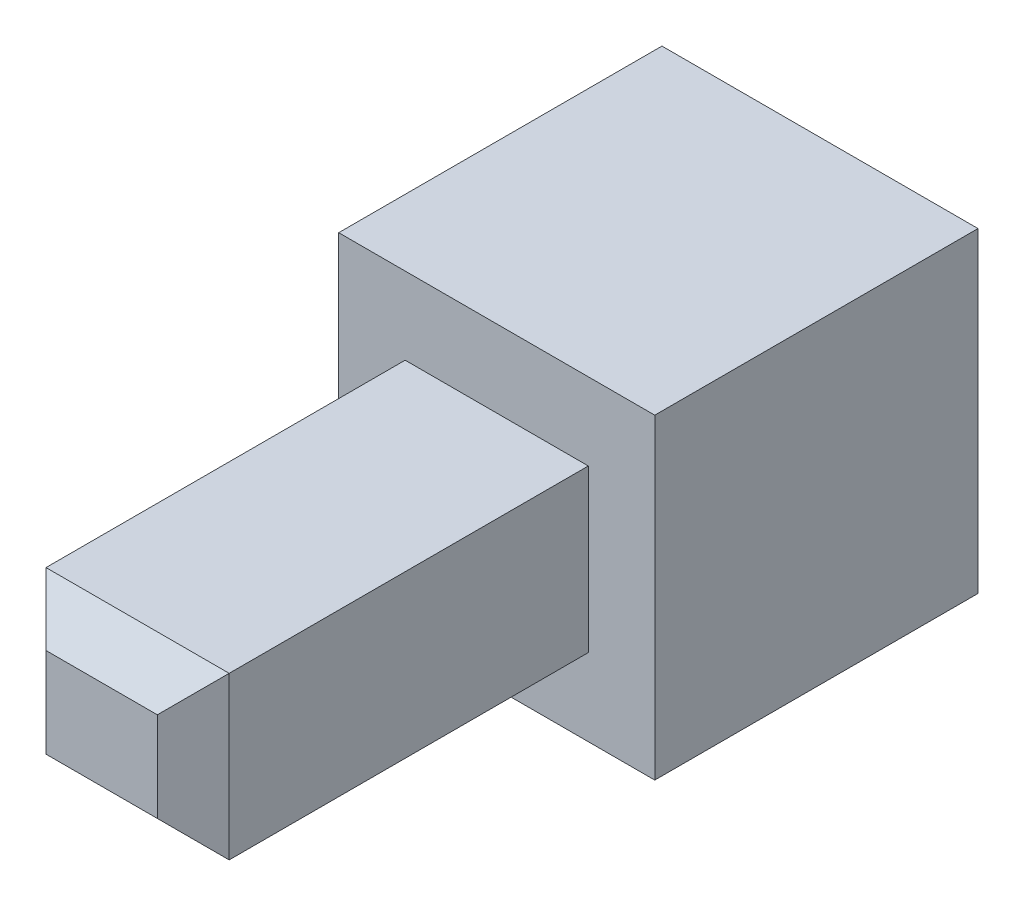
ISO-10303-21;
HEADER;
FILE_DESCRIPTION(('STEP AP214'),'2;1');
FILE_NAME('part.step','',(''),(''),'','','');
FILE_SCHEMA(('AUTOMOTIVE_DESIGN { 1 0 10303 214 1 1 1 1 }'));
ENDSEC;
DATA;
#1=APPLICATION_CONTEXT('core data for automotive mechanical design processes');
#2=APPLICATION_PROTOCOL_DEFINITION('international standard','automotive_design',2000,#1);
#3=PRODUCT_CONTEXT('',#1,'mechanical');
#4=PRODUCT('Part','Part','',(#3));
#5=PRODUCT_RELATED_PRODUCT_CATEGORY('part','',(#4));
#6=PRODUCT_DEFINITION_FORMATION('','',#4);
#7=PRODUCT_DEFINITION_CONTEXT('part definition',#1,'design');
#8=PRODUCT_DEFINITION('design','',#6,#7);
#9=PRODUCT_DEFINITION_SHAPE('','',#8);
#10=(LENGTH_UNIT() NAMED_UNIT(*) SI_UNIT(.MILLI.,.METRE.));
#11=(NAMED_UNIT(*) PLANE_ANGLE_UNIT() SI_UNIT($,.RADIAN.));
#12=(NAMED_UNIT(*) SI_UNIT($,.STERADIAN.) SOLID_ANGLE_UNIT());
#13=UNCERTAINTY_MEASURE_WITH_UNIT(LENGTH_MEASURE(1.E-05),#10,'distance_accuracy_value','');
#14=(GEOMETRIC_REPRESENTATION_CONTEXT(3) GLOBAL_UNCERTAINTY_ASSIGNED_CONTEXT((#13)) GLOBAL_UNIT_ASSIGNED_CONTEXT((#10,
#11,#12)) REPRESENTATION_CONTEXT('',''));
#15=CARTESIAN_POINT('',(0.,0.,0.));
#16=DIRECTION('',(0.,0.,1.));
#17=DIRECTION('',(1.,0.,0.));
#18=AXIS2_PLACEMENT_3D('',#15,#16,#17);
#19=CARTESIAN_POINT('',(-33.152555071098,95.682627612663,-10.400000378181));
#20=DIRECTION('',(1.,0.,0.));
#21=DIRECTION('',(0.,0.,-1.));
#22=AXIS2_PLACEMENT_3D('',#19,#20,#21);
#23=PLANE('',#22);
#24=DIRECTION('',(0.,0.,-1.));
#25=VECTOR('',#24,1.);
#26=CARTESIAN_POINT('',(-33.152555071098,95.682627612663,-10.400000378181));
#27=LINE('',#26,#25);
#28=CARTESIAN_POINT('',(-33.152555071098,95.682627612663,-5.40000037818102));
#29=VERTEX_POINT('',#28);
#30=CARTESIAN_POINT('',(-33.152555071098,95.682627612663,-14.400000378181));
#31=VERTEX_POINT('',#30);
#32=EDGE_CURVE('E223',#29,#31,#27,.T.);
#33=ORIENTED_EDGE('',*,*,#32,.T.);
#34=DIRECTION('',(0.,-1.,0.));
#35=VECTOR('',#34,1.);
#36=CARTESIAN_POINT('',(-33.152555071098,95.682627612663,-14.400000378181));
#37=LINE('',#36,#35);
#38=CARTESIAN_POINT('',(-33.152555071098,86.882627803397,-14.400000378181));
#39=VERTEX_POINT('',#38);
#40=EDGE_CURVE('E191',#31,#39,#37,.T.);
#41=ORIENTED_EDGE('',*,*,#40,.T.);
#42=DIRECTION('',(0.,0.,-1.));
#43=VECTOR('',#42,1.);
#44=CARTESIAN_POINT('',(-33.152555071098,86.882627803397,-10.400000378181));
#45=LINE('',#44,#43);
#46=CARTESIAN_POINT('',(-33.152555071098,86.882627803397,-5.40000037818102));
#47=VERTEX_POINT('',#46);
#48=EDGE_CURVE('E229',#47,#39,#45,.T.);
#49=ORIENTED_EDGE('',*,*,#48,.F.);
#50=DIRECTION('',(0.,-1.,0.));
#51=VECTOR('',#50,1.);
#52=CARTESIAN_POINT('',(-33.152555071098,95.682627612663,-5.40000037818102));
#53=LINE('',#52,#51);
#54=EDGE_CURVE('E167',#29,#47,#53,.T.);
#55=ORIENTED_EDGE('',*,*,#54,.F.);
#56=EDGE_LOOP('',(#33,#41,#49,#55));
#57=FACE_BOUND('',#56,.T.);
#58=ADVANCED_FACE('F37',(#57),#23,.F.);
#59=CARTESIAN_POINT('',(-33.152555071098,86.882627803397,-10.400000378181));
#60=DIRECTION('',(0.,1.,0.));
#61=DIRECTION('',(0.,0.,1.));
#62=AXIS2_PLACEMENT_3D('',#59,#60,#61);
#63=PLANE('',#62);
#64=ORIENTED_EDGE('',*,*,#48,.T.);
#65=DIRECTION('',(1.,0.,0.));
#66=VECTOR('',#65,1.);
#67=CARTESIAN_POINT('',(-33.152555071098,86.882627803397,-14.400000378181));
#68=LINE('',#67,#66);
#69=CARTESIAN_POINT('',(-24.352555261832,86.882627803397,-14.400000378181));
#70=VERTEX_POINT('',#69);
#71=EDGE_CURVE('E194',#39,#70,#68,.T.);
#72=ORIENTED_EDGE('',*,*,#71,.T.);
#73=DIRECTION('',(0.,0.,-1.));
#74=VECTOR('',#73,1.);
#75=CARTESIAN_POINT('',(-24.352555261832,86.882627803397,-10.400000378181));
#76=LINE('',#75,#74);
#77=CARTESIAN_POINT('',(-24.352555261832,86.882627803397,-5.40000037818102));
#78=VERTEX_POINT('',#77);
#79=EDGE_CURVE('E227',#78,#70,#76,.T.);
#80=ORIENTED_EDGE('',*,*,#79,.F.);
#81=DIRECTION('',(1.,0.,0.));
#82=VECTOR('',#81,1.);
#83=CARTESIAN_POINT('',(-33.152555071098,86.882627803397,-5.40000037818102));
#84=LINE('',#83,#82);
#85=EDGE_CURVE('E170',#47,#78,#84,.T.);
#86=ORIENTED_EDGE('',*,*,#85,.F.);
#87=EDGE_LOOP('',(#64,#72,#80,#86));
#88=FACE_BOUND('',#87,.T.);
#89=ADVANCED_FACE('F283',(#88),#63,.F.);
#90=CARTESIAN_POINT('',(-24.352555261832,95.682627612663,-10.400000378181));
#91=DIRECTION('',(-1.,0.,0.));
#92=DIRECTION('',(0.,0.,1.));
#93=AXIS2_PLACEMENT_3D('',#90,#91,#92);
#94=PLANE('',#93);
#95=ORIENTED_EDGE('',*,*,#79,.T.);
#96=DIRECTION('',(0.,1.,0.));
#97=VECTOR('',#96,1.);
#98=CARTESIAN_POINT('',(-24.352555261832,95.682627612663,-14.400000378181));
#99=LINE('',#98,#97);
#100=CARTESIAN_POINT('',(-24.352555261832,95.682627612663,-14.400000378181));
#101=VERTEX_POINT('',#100);
#102=EDGE_CURVE('E197',#70,#101,#99,.T.);
#103=ORIENTED_EDGE('',*,*,#102,.T.);
#104=DIRECTION('',(0.,0.,-1.));
#105=VECTOR('',#104,1.);
#106=CARTESIAN_POINT('',(-24.352555261832,95.682627612663,-10.400000378181));
#107=LINE('',#106,#105);
#108=CARTESIAN_POINT('',(-24.352555261832,95.682627612663,-5.40000037818102));
#109=VERTEX_POINT('',#108);
#110=EDGE_CURVE('E225',#109,#101,#107,.T.);
#111=ORIENTED_EDGE('',*,*,#110,.F.);
#112=DIRECTION('',(0.,1.,0.));
#113=VECTOR('',#112,1.);
#114=CARTESIAN_POINT('',(-24.352555261832,95.682627612663,-5.40000037818102));
#115=LINE('',#114,#113);
#116=EDGE_CURVE('E173',#78,#109,#115,.T.);
#117=ORIENTED_EDGE('',*,*,#116,.F.);
#118=EDGE_LOOP('',(#95,#103,#111,#117));
#119=FACE_BOUND('',#118,.T.);
#120=ADVANCED_FACE('F289',(#119),#94,.F.);
#121=CARTESIAN_POINT('',(-33.152555071098,95.682627612663,-10.400000378181));
#122=DIRECTION('',(0.,-1.,0.));
#123=DIRECTION('',(0.,0.,-1.));
#124=AXIS2_PLACEMENT_3D('',#121,#122,#123);
#125=PLANE('',#124);
#126=ORIENTED_EDGE('',*,*,#110,.T.);
#127=DIRECTION('',(-1.,0.,0.));
#128=VECTOR('',#127,1.);
#129=CARTESIAN_POINT('',(-33.152555071098,95.682627612663,-14.400000378181));
#130=LINE('',#129,#128);
#131=EDGE_CURVE('E200',#101,#31,#130,.T.);
#132=ORIENTED_EDGE('',*,*,#131,.T.);
#133=ORIENTED_EDGE('',*,*,#32,.F.);
#134=DIRECTION('',(-1.,0.,0.));
#135=VECTOR('',#134,1.);
#136=CARTESIAN_POINT('',(-33.152555071098,95.682627612663,-5.40000037818102));
#137=LINE('',#136,#135);
#138=EDGE_CURVE('E176',#109,#29,#137,.T.);
#139=ORIENTED_EDGE('',*,*,#138,.F.);
#140=EDGE_LOOP('',(#126,#132,#133,#139));
#141=FACE_BOUND('',#140,.T.);
#142=ADVANCED_FACE('F380',(#141),#125,.F.);
#143=CARTESIAN_POINT('',(-31.952555071098,94.482627612663,-10.400000378181));
#144=DIRECTION('',(1.,0.,0.));
#145=DIRECTION('',(0.,0.,-1.));
#146=AXIS2_PLACEMENT_3D('',#143,#144,#145);
#147=PLANE('',#146);
#148=DIRECTION('',(0.,0.,-1.));
#149=VECTOR('',#148,1.);
#150=CARTESIAN_POINT('',(-31.952555071098,88.082627803397,-10.400000378181));
#151=LINE('',#150,#149);
#152=CARTESIAN_POINT('',(-31.952555071098,88.082627803397,-10.400000378181));
#153=VERTEX_POINT('',#152);
#154=CARTESIAN_POINT('',(-31.952555071098,88.082627803397,-14.400000378181));
#155=VERTEX_POINT('',#154);
#156=EDGE_CURVE('E221',#153,#155,#151,.T.);
#157=ORIENTED_EDGE('',*,*,#156,.T.);
#158=DIRECTION('',(0.,-1.,0.));
#159=VECTOR('',#158,1.);
#160=CARTESIAN_POINT('',(-31.952555071098,94.482627612663,-14.400000378181));
#161=LINE('',#160,#159);
#162=CARTESIAN_POINT('',(-31.952555071098,94.482627612663,-14.400000378181));
#163=VERTEX_POINT('',#162);
#164=EDGE_CURVE('E179',#163,#155,#161,.T.);
#165=ORIENTED_EDGE('',*,*,#164,.F.);
#166=DIRECTION('',(0.,0.,-1.));
#167=VECTOR('',#166,1.);
#168=CARTESIAN_POINT('',(-31.952555071098,94.482627612663,-10.400000378181));
#169=LINE('',#168,#167);
#170=CARTESIAN_POINT('',(-31.952555071098,94.482627612663,-10.400000378181));
#171=VERTEX_POINT('',#170);
#172=EDGE_CURVE('E215',#171,#163,#169,.T.);
#173=ORIENTED_EDGE('',*,*,#172,.F.);
#174=DIRECTION('',(0.,-1.,0.));
#175=VECTOR('',#174,1.);
#176=CARTESIAN_POINT('',(-31.952555071098,94.482627612663,-10.400000378181));
#177=LINE('',#176,#175);
#178=EDGE_CURVE('E203',#171,#153,#177,.T.);
#179=ORIENTED_EDGE('',*,*,#178,.T.);
#180=EDGE_LOOP('',(#157,#165,#173,#179));
#181=FACE_BOUND('',#180,.T.);
#182=ADVANCED_FACE('F387',(#181),#147,.T.);
#183=CARTESIAN_POINT('',(-31.952555071098,88.082627803397,-10.400000378181));
#184=DIRECTION('',(0.,1.,0.));
#185=DIRECTION('',(0.,0.,1.));
#186=AXIS2_PLACEMENT_3D('',#183,#184,#185);
#187=PLANE('',#186);
#188=DIRECTION('',(0.,0.,-1.));
#189=VECTOR('',#188,1.);
#190=CARTESIAN_POINT('',(-25.552555261832,88.082627803397,-10.400000378181));
#191=LINE('',#190,#189);
#192=CARTESIAN_POINT('',(-25.552555261832,88.082627803397,-10.400000378181));
#193=VERTEX_POINT('',#192);
#194=CARTESIAN_POINT('',(-25.552555261832,88.082627803397,-14.400000378181));
#195=VERTEX_POINT('',#194);
#196=EDGE_CURVE('E219',#193,#195,#191,.T.);
#197=ORIENTED_EDGE('',*,*,#196,.T.);
#198=DIRECTION('',(1.,0.,0.));
#199=VECTOR('',#198,1.);
#200=CARTESIAN_POINT('',(-31.952555071098,88.082627803397,-14.400000378181));
#201=LINE('',#200,#199);
#202=EDGE_CURVE('E182',#155,#195,#201,.T.);
#203=ORIENTED_EDGE('',*,*,#202,.F.);
#204=ORIENTED_EDGE('',*,*,#156,.F.);
#205=DIRECTION('',(1.,0.,0.));
#206=VECTOR('',#205,1.);
#207=CARTESIAN_POINT('',(-31.952555071098,88.082627803397,-10.400000378181));
#208=LINE('',#207,#206);
#209=EDGE_CURVE('E206',#153,#193,#208,.T.);
#210=ORIENTED_EDGE('',*,*,#209,.T.);
#211=EDGE_LOOP('',(#197,#203,#204,#210));
#212=FACE_BOUND('',#211,.T.);
#213=ADVANCED_FACE('F442',(#212),#187,.T.);
#214=CARTESIAN_POINT('',(-25.552555261832,94.482627612663,-10.400000378181));
#215=DIRECTION('',(-1.,0.,0.));
#216=DIRECTION('',(0.,0.,1.));
#217=AXIS2_PLACEMENT_3D('',#214,#215,#216);
#218=PLANE('',#217);
#219=DIRECTION('',(0.,0.,-1.));
#220=VECTOR('',#219,1.);
#221=CARTESIAN_POINT('',(-25.552555261832,94.482627612663,-10.400000378181));
#222=LINE('',#221,#220);
#223=CARTESIAN_POINT('',(-25.552555261832,94.482627612663,-10.400000378181));
#224=VERTEX_POINT('',#223);
#225=CARTESIAN_POINT('',(-25.552555261832,94.482627612663,-14.400000378181));
#226=VERTEX_POINT('',#225);
#227=EDGE_CURVE('E217',#224,#226,#222,.T.);
#228=ORIENTED_EDGE('',*,*,#227,.T.);
#229=DIRECTION('',(0.,1.,0.));
#230=VECTOR('',#229,1.);
#231=CARTESIAN_POINT('',(-25.552555261832,94.482627612663,-14.400000378181));
#232=LINE('',#231,#230);
#233=EDGE_CURVE('E185',#195,#226,#232,.T.);
#234=ORIENTED_EDGE('',*,*,#233,.F.);
#235=ORIENTED_EDGE('',*,*,#196,.F.);
#236=DIRECTION('',(0.,1.,0.));
#237=VECTOR('',#236,1.);
#238=CARTESIAN_POINT('',(-25.552555261832,94.482627612663,-10.400000378181));
#239=LINE('',#238,#237);
#240=EDGE_CURVE('E209',#193,#224,#239,.T.);
#241=ORIENTED_EDGE('',*,*,#240,.T.);
#242=EDGE_LOOP('',(#228,#234,#235,#241));
#243=FACE_BOUND('',#242,.T.);
#244=ADVANCED_FACE('F433',(#243),#218,.T.);
#245=CARTESIAN_POINT('',(-31.952555071098,94.482627612663,-10.400000378181));
#246=DIRECTION('',(0.,-1.,0.));
#247=DIRECTION('',(0.,0.,-1.));
#248=AXIS2_PLACEMENT_3D('',#245,#246,#247);
#249=PLANE('',#248);
#250=ORIENTED_EDGE('',*,*,#172,.T.);
#251=DIRECTION('',(-1.,0.,0.));
#252=VECTOR('',#251,1.);
#253=CARTESIAN_POINT('',(-31.952555071098,94.482627612663,-14.400000378181));
#254=LINE('',#253,#252);
#255=EDGE_CURVE('E188',#226,#163,#254,.T.);
#256=ORIENTED_EDGE('',*,*,#255,.F.);
#257=ORIENTED_EDGE('',*,*,#227,.F.);
#258=DIRECTION('',(-1.,0.,0.));
#259=VECTOR('',#258,1.);
#260=CARTESIAN_POINT('',(-31.952555071098,94.482627612663,-10.400000378181));
#261=LINE('',#260,#259);
#262=EDGE_CURVE('E212',#224,#171,#261,.T.);
#263=ORIENTED_EDGE('',*,*,#262,.T.);
#264=EDGE_LOOP('',(#250,#256,#257,#263));
#265=FACE_BOUND('',#264,.T.);
#266=ADVANCED_FACE('F425',(#265),#249,.T.);
#267=CARTESIAN_POINT('',(0.,0.,-14.400000378181));
#268=DIRECTION('',(0.,0.,1.));
#269=DIRECTION('',(1.,0.,0.));
#270=AXIS2_PLACEMENT_3D('',#267,#268,#269);
#271=PLANE('',#270);
#272=ORIENTED_EDGE('',*,*,#255,.T.);
#273=ORIENTED_EDGE('',*,*,#164,.T.);
#274=ORIENTED_EDGE('',*,*,#202,.T.);
#275=ORIENTED_EDGE('',*,*,#233,.T.);
#276=EDGE_LOOP('',(#272,#273,#274,#275));
#277=FACE_BOUND('',#276,.T.);
#278=ORIENTED_EDGE('',*,*,#40,.F.);
#279=ORIENTED_EDGE('',*,*,#131,.F.);
#280=ORIENTED_EDGE('',*,*,#102,.F.);
#281=ORIENTED_EDGE('',*,*,#71,.F.);
#282=EDGE_LOOP('',(#278,#279,#280,#281));
#283=FACE_BOUND('',#282,.T.);
#284=ADVANCED_FACE('F375',(#277,#283),#271,.F.);
#285=CARTESIAN_POINT('',(0.,0.,-10.400000378181));
#286=DIRECTION('',(0.,0.,1.));
#287=DIRECTION('',(1.,0.,0.));
#288=AXIS2_PLACEMENT_3D('',#285,#286,#287);
#289=PLANE('',#288);
#290=ORIENTED_EDGE('',*,*,#209,.F.);
#291=ORIENTED_EDGE('',*,*,#178,.F.);
#292=ORIENTED_EDGE('',*,*,#262,.F.);
#293=ORIENTED_EDGE('',*,*,#240,.F.);
#294=EDGE_LOOP('',(#290,#291,#292,#293));
#295=FACE_BOUND('',#294,.T.);
#296=ADVANCED_FACE('F367',(#295),#289,.F.);
#297=CARTESIAN_POINT('',(0.,0.,-5.40000037818102));
#298=DIRECTION('',(0.,0.,1.));
#299=DIRECTION('',(1.,0.,0.));
#300=AXIS2_PLACEMENT_3D('',#297,#298,#299);
#301=PLANE('',#300);
#302=DIRECTION('',(0.,-1.,0.));
#303=VECTOR('',#302,1.);
#304=CARTESIAN_POINT('',(-31.302555105627,93.532627657058,-5.40000037818102));
#305=LINE('',#304,#303);
#306=CARTESIAN_POINT('',(-31.302555105627,93.532627657058,-5.40000037818102));
#307=VERTEX_POINT('',#306);
#308=CARTESIAN_POINT('',(-31.302555105627,89.032627759002,-5.40000037818102));
#309=VERTEX_POINT('',#308);
#310=EDGE_CURVE('E158',#307,#309,#305,.T.);
#311=ORIENTED_EDGE('',*,*,#310,.F.);
#312=DIRECTION('',(-1.,0.,0.));
#313=VECTOR('',#312,1.);
#314=CARTESIAN_POINT('',(-31.302555105627,93.532627657058,-5.40000037818102));
#315=LINE('',#314,#313);
#316=CARTESIAN_POINT('',(-26.202555227303,93.532627657058,-5.40000037818102));
#317=VERTEX_POINT('',#316);
#318=EDGE_CURVE('E155',#317,#307,#315,.T.);
#319=ORIENTED_EDGE('',*,*,#318,.F.);
#320=DIRECTION('',(0.,1.,0.));
#321=VECTOR('',#320,1.);
#322=CARTESIAN_POINT('',(-26.202555227303,93.532627657058,-5.40000037818102));
#323=LINE('',#322,#321);
#324=CARTESIAN_POINT('',(-26.202555227303,89.032627759002,-5.40000037818102));
#325=VERTEX_POINT('',#324);
#326=EDGE_CURVE('E141',#325,#317,#323,.T.);
#327=ORIENTED_EDGE('',*,*,#326,.F.);
#328=DIRECTION('',(1.,0.,0.));
#329=VECTOR('',#328,1.);
#330=CARTESIAN_POINT('',(-31.302555105627,89.032627759002,-5.40000037818102));
#331=LINE('',#330,#329);
#332=EDGE_CURVE('E152',#309,#325,#331,.T.);
#333=ORIENTED_EDGE('',*,*,#332,.F.);
#334=EDGE_LOOP('',(#311,#319,#327,#333));
#335=FACE_BOUND('',#334,.T.);
#336=ORIENTED_EDGE('',*,*,#54,.T.);
#337=ORIENTED_EDGE('',*,*,#85,.T.);
#338=ORIENTED_EDGE('',*,*,#116,.T.);
#339=ORIENTED_EDGE('',*,*,#138,.T.);
#340=EDGE_LOOP('',(#336,#337,#338,#339));
#341=FACE_BOUND('',#340,.T.);
#342=ADVANCED_FACE('F150',(#335,#341),#301,.T.);
#343=CARTESIAN_POINT('',(-31.302555105627,93.532627657058,5.59999962181898));
#344=DIRECTION('',(1.,0.,0.));
#345=DIRECTION('',(0.,0.,-1.));
#346=AXIS2_PLACEMENT_3D('',#343,#344,#345);
#347=PLANE('',#346);
#348=DIRECTION('',(0.,0.,-1.));
#349=VECTOR('',#348,1.);
#350=CARTESIAN_POINT('',(-31.302555105627,89.032627759002,5.59999962181898));
#351=LINE('',#350,#349);
#352=CARTESIAN_POINT('',(-31.302555105627,89.032627759002,4.59999962181898));
#353=VERTEX_POINT('',#352);
#354=EDGE_CURVE('E143',#353,#309,#351,.T.);
#355=ORIENTED_EDGE('',*,*,#354,.F.);
#356=DIRECTION('',(0.,1.,0.));
#357=VECTOR('',#356,1.);
#358=CARTESIAN_POINT('',(-31.302555105627,93.532627657058,4.59999962181898));
#359=LINE('',#358,#357);
#360=CARTESIAN_POINT('',(-31.302555105627,93.532627657058,4.59999962181898));
#361=VERTEX_POINT('',#360);
#362=EDGE_CURVE('E11',#353,#361,#359,.T.);
#363=ORIENTED_EDGE('',*,*,#362,.T.);
#364=DIRECTION('',(0.,0.,-1.));
#365=VECTOR('',#364,1.);
#366=CARTESIAN_POINT('',(-31.302555105627,93.532627657058,5.59999962181898));
#367=LINE('',#366,#365);
#368=EDGE_CURVE('E163',#361,#307,#367,.T.);
#369=ORIENTED_EDGE('',*,*,#368,.T.);
#370=ORIENTED_EDGE('',*,*,#310,.T.);
#371=EDGE_LOOP('',(#355,#363,#369,#370));
#372=FACE_BOUND('',#371,.T.);
#373=ADVANCED_FACE('F266',(#372),#347,.F.);
#374=CARTESIAN_POINT('',(-31.302555105627,89.032627759002,5.59999962181898));
#375=DIRECTION('',(0.,1.,0.));
#376=DIRECTION('',(0.,0.,1.));
#377=AXIS2_PLACEMENT_3D('',#374,#375,#376);
#378=PLANE('',#377);
#379=DIRECTION('',(0.,0.,-1.));
#380=VECTOR('',#379,1.);
#381=CARTESIAN_POINT('',(-26.202555227303,89.032627759002,5.59999962181898));
#382=LINE('',#381,#380);
#383=CARTESIAN_POINT('',(-26.202555227303,89.032627759002,4.59999962181898));
#384=VERTEX_POINT('',#383);
#385=EDGE_CURVE('E138',#384,#325,#382,.T.);
#386=ORIENTED_EDGE('',*,*,#385,.F.);
#387=DIRECTION('',(-1.,0.,0.));
#388=VECTOR('',#387,1.);
#389=CARTESIAN_POINT('',(-31.302555105627,89.032627759002,4.59999962181898));
#390=LINE('',#389,#388);
#391=EDGE_CURVE('E47',#384,#353,#390,.T.);
#392=ORIENTED_EDGE('',*,*,#391,.T.);
#393=ORIENTED_EDGE('',*,*,#354,.T.);
#394=ORIENTED_EDGE('',*,*,#332,.T.);
#395=EDGE_LOOP('',(#386,#392,#393,#394));
#396=FACE_BOUND('',#395,.T.);
#397=ADVANCED_FACE('F157',(#396),#378,.F.);
#398=CARTESIAN_POINT('',(-26.202555227303,93.532627657058,5.59999962181898));
#399=DIRECTION('',(-1.,0.,0.));
#400=DIRECTION('',(0.,0.,1.));
#401=AXIS2_PLACEMENT_3D('',#398,#399,#400);
#402=PLANE('',#401);
#403=DIRECTION('',(0.,0.,-1.));
#404=VECTOR('',#403,1.);
#405=CARTESIAN_POINT('',(-26.202555227303,93.532627657058,5.59999962181898));
#406=LINE('',#405,#404);
#407=CARTESIAN_POINT('',(-26.202555227303,93.532627657058,4.59999962181898));
#408=VERTEX_POINT('',#407);
#409=EDGE_CURVE('E144',#408,#317,#406,.T.);
#410=ORIENTED_EDGE('',*,*,#409,.F.);
#411=DIRECTION('',(0.,-1.,0.));
#412=VECTOR('',#411,1.);
#413=CARTESIAN_POINT('',(-26.202555227303,89.032627759002,4.59999962181898));
#414=LINE('',#413,#412);
#415=EDGE_CURVE('E62',#408,#384,#414,.T.);
#416=ORIENTED_EDGE('',*,*,#415,.T.);
#417=ORIENTED_EDGE('',*,*,#385,.T.);
#418=ORIENTED_EDGE('',*,*,#326,.T.);
#419=EDGE_LOOP('',(#410,#416,#417,#418));
#420=FACE_BOUND('',#419,.T.);
#421=ADVANCED_FACE('F140',(#420),#402,.F.);
#422=CARTESIAN_POINT('',(-31.302555105627,93.532627657058,5.59999962181898));
#423=DIRECTION('',(0.,-1.,0.));
#424=DIRECTION('',(0.,0.,-1.));
#425=AXIS2_PLACEMENT_3D('',#422,#423,#424);
#426=PLANE('',#425);
#427=ORIENTED_EDGE('',*,*,#368,.F.);
#428=DIRECTION('',(1.,0.,0.));
#429=VECTOR('',#428,1.);
#430=CARTESIAN_POINT('',(-26.202555227303,93.532627657058,4.59999962181898));
#431=LINE('',#430,#429);
#432=EDGE_CURVE('E240',#361,#408,#431,.T.);
#433=ORIENTED_EDGE('',*,*,#432,.T.);
#434=ORIENTED_EDGE('',*,*,#409,.T.);
#435=ORIENTED_EDGE('',*,*,#318,.T.);
#436=EDGE_LOOP('',(#427,#433,#434,#435));
#437=FACE_BOUND('',#436,.T.);
#438=ADVANCED_FACE('F269',(#437),#426,.F.);
#439=CARTESIAN_POINT('',(0.,0.,5.59999962181898));
#440=DIRECTION('',(0.,0.,1.));
#441=DIRECTION('',(1.,0.,0.));
#442=AXIS2_PLACEMENT_3D('',#439,#440,#441);
#443=PLANE('',#442);
#444=DIRECTION('',(0.,1.,0.));
#445=VECTOR('',#444,1.);
#446=CARTESIAN_POINT('',(-27.202555227303,93.532627657058,5.59999962181898));
#447=LINE('',#446,#445);
#448=CARTESIAN_POINT('',(-27.202555227303,90.032627759002,5.59999962181898));
#449=VERTEX_POINT('',#448);
#450=CARTESIAN_POINT('',(-27.202555227303,92.532627657058,5.59999962181898));
#451=VERTEX_POINT('',#450);
#452=EDGE_CURVE('E235',#449,#451,#447,.T.);
#453=ORIENTED_EDGE('',*,*,#452,.T.);
#454=DIRECTION('',(-1.,0.,0.));
#455=VECTOR('',#454,1.);
#456=CARTESIAN_POINT('',(-31.302555105627,92.532627657058,5.59999962181898));
#457=LINE('',#456,#455);
#458=CARTESIAN_POINT('',(-30.302555105627,92.532627657058,5.59999962181898));
#459=VERTEX_POINT('',#458);
#460=EDGE_CURVE('E237',#451,#459,#457,.T.);
#461=ORIENTED_EDGE('',*,*,#460,.T.);
#462=DIRECTION('',(0.,-1.,0.));
#463=VECTOR('',#462,1.);
#464=CARTESIAN_POINT('',(-30.302555105627,89.032627759002,5.59999962181898));
#465=LINE('',#464,#463);
#466=CARTESIAN_POINT('',(-30.302555105627,90.032627759002,5.59999962181898));
#467=VERTEX_POINT('',#466);
#468=EDGE_CURVE('E231',#459,#467,#465,.T.);
#469=ORIENTED_EDGE('',*,*,#468,.T.);
#470=DIRECTION('',(1.,0.,0.));
#471=VECTOR('',#470,1.);
#472=CARTESIAN_POINT('',(-26.202555227303,90.032627759002,5.59999962181898));
#473=LINE('',#472,#471);
#474=EDGE_CURVE('E233',#467,#449,#473,.T.);
#475=ORIENTED_EDGE('',*,*,#474,.T.);
#476=EDGE_LOOP('',(#453,#461,#469,#475));
#477=FACE_BOUND('',#476,.T.);
#478=ADVANCED_FACE('F274',(#477),#443,.T.);
#479=CARTESIAN_POINT('',(0.,90.032627759002,5.59999962181898));
#480=DIRECTION('',(0.,-0.70710678118655,0.707106781186545));
#481=DIRECTION('',(-1.,0.,0.));
#482=AXIS2_PLACEMENT_3D('',#479,#480,#481);
#483=PLANE('',#482);
#484=DIRECTION('',(0.577350269189623,0.577350269189625,0.577350269189629));
#485=VECTOR('',#484,1.);
#486=CARTESIAN_POINT('',(-60.3134310252942,60.0217518393348,-24.4108762978485));
#487=LINE('',#486,#485);
#488=EDGE_CURVE('E248',#353,#467,#487,.T.);
#489=ORIENTED_EDGE('',*,*,#488,.F.);
#490=ORIENTED_EDGE('',*,*,#391,.F.);
#491=DIRECTION('',(-0.577350269189623,0.577350269189625,0.577350269189629));
#492=VECTOR('',#491,1.);
#493=CARTESIAN_POINT('',(-18.1350368182021,80.9651093499011,-3.46751878728202));
#494=LINE('',#493,#492);
#495=EDGE_CURVE('E42',#449,#384,#494,.F.);
#496=ORIENTED_EDGE('',*,*,#495,.F.);
#497=ORIENTED_EDGE('',*,*,#474,.F.);
#498=EDGE_LOOP('',(#489,#490,#496,#497));
#499=FACE_BOUND('',#498,.T.);
#500=ADVANCED_FACE('F40',(#499),#483,.T.);
#501=CARTESIAN_POINT('',(-27.202555227303,0.,5.59999962181898));
#502=DIRECTION('',(0.707106781186551,0.,0.707106781186544));
#503=DIRECTION('',(0.,-1.,0.));
#504=AXIS2_PLACEMENT_3D('',#501,#502,#503);
#505=PLANE('',#504);
#506=ORIENTED_EDGE('',*,*,#495,.T.);
#507=ORIENTED_EDGE('',*,*,#415,.F.);
#508=DIRECTION('',(-0.577350269189623,-0.577350269189625,0.577350269189629));
#509=VECTOR('',#508,1.);
#510=CARTESIAN_POINT('',(-58.0467644463222,61.6884184380387,36.4442088408385));
#511=LINE('',#510,#509);
#512=EDGE_CURVE('E247',#451,#408,#511,.F.);
#513=ORIENTED_EDGE('',*,*,#512,.F.);
#514=ORIENTED_EDGE('',*,*,#452,.F.);
#515=EDGE_LOOP('',(#506,#507,#513,#514));
#516=FACE_BOUND('',#515,.T.);
#517=ADVANCED_FACE('F258',(#516),#505,.T.);
#518=CARTESIAN_POINT('',(-30.302555105627,0.,5.59999962181898));
#519=DIRECTION('',(-0.707106781186551,0.,0.707106781186544));
#520=DIRECTION('',(0.,1.,0.));
#521=AXIS2_PLACEMENT_3D('',#518,#519,#520);
#522=PLANE('',#521);
#523=ORIENTED_EDGE('',*,*,#488,.T.);
#524=ORIENTED_EDGE('',*,*,#468,.F.);
#525=DIRECTION('',(-0.577350269189623,0.577350269189625,-0.577350269189629));
#526=VECTOR('',#525,1.);
#527=CARTESIAN_POINT('',(0.541654113392166,61.6884184380387,36.4442088408385));
#528=LINE('',#527,#526);
#529=EDGE_CURVE('E245',#361,#459,#528,.F.);
#530=ORIENTED_EDGE('',*,*,#529,.F.);
#531=ORIENTED_EDGE('',*,*,#362,.F.);
#532=EDGE_LOOP('',(#523,#524,#530,#531));
#533=FACE_BOUND('',#532,.T.);
#534=ADVANCED_FACE('F263',(#533),#522,.T.);
#535=CARTESIAN_POINT('',(0.,92.532627657058,5.59999962181898));
#536=DIRECTION('',(0.,0.70710678118655,0.707106781186545));
#537=DIRECTION('',(1.,0.,0.));
#538=AXIS2_PLACEMENT_3D('',#535,#536,#537);
#539=PLANE('',#538);
#540=ORIENTED_EDGE('',*,*,#512,.T.);
#541=ORIENTED_EDGE('',*,*,#432,.F.);
#542=ORIENTED_EDGE('',*,*,#529,.T.);
#543=ORIENTED_EDGE('',*,*,#460,.F.);
#544=EDGE_LOOP('',(#540,#541,#542,#543));
#545=FACE_BOUND('',#544,.T.);
#546=ADVANCED_FACE('F271',(#545),#539,.T.);
#547=CLOSED_SHELL('',(#58,#89,#120,#142,#182,#213,#244,#266,#284,#296,#342,#373,#397,#421,#438,
#478,#500,#517,#534,#546));
#548=MANIFOLD_SOLID_BREP('B2',#547);
#549=ADVANCED_BREP_SHAPE_REPRESENTATION('',(#18,#548),#14);
#550=SHAPE_DEFINITION_REPRESENTATION(#9,#549);
ENDSEC;
END-ISO-10303-21;
